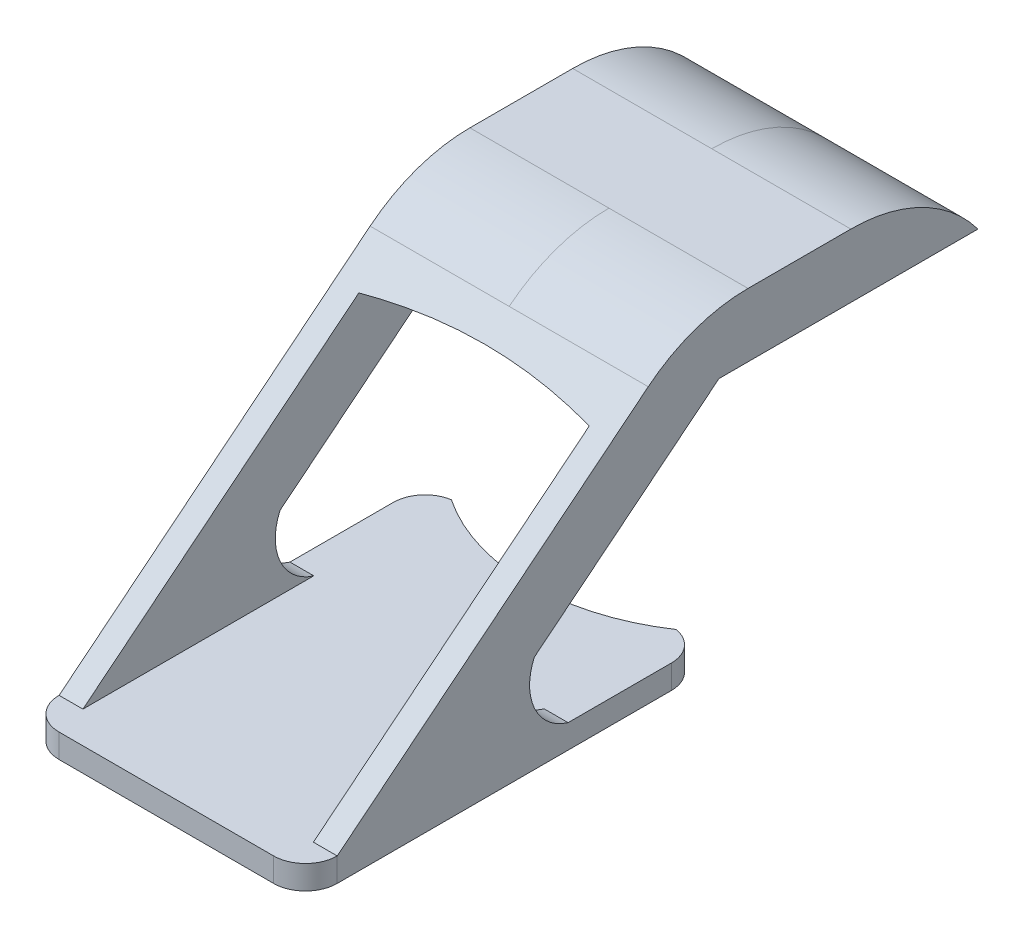
ISO-10303-21;
HEADER;
FILE_DESCRIPTION(('STEP AP214'),'2;1');
FILE_NAME('part.step','',(''),(''),'','','');
FILE_SCHEMA(('AUTOMOTIVE_DESIGN { 1 0 10303 214 1 1 1 1 }'));
ENDSEC;
DATA;
#1=APPLICATION_CONTEXT('core data for automotive mechanical design processes');
#2=APPLICATION_PROTOCOL_DEFINITION('international standard','automotive_design',2000,#1);
#3=PRODUCT_CONTEXT('',#1,'mechanical');
#4=PRODUCT('Part','Part','',(#3));
#5=PRODUCT_RELATED_PRODUCT_CATEGORY('part','',(#4));
#6=PRODUCT_DEFINITION_FORMATION('','',#4);
#7=PRODUCT_DEFINITION_CONTEXT('part definition',#1,'design');
#8=PRODUCT_DEFINITION('design','',#6,#7);
#9=PRODUCT_DEFINITION_SHAPE('','',#8);
#10=(LENGTH_UNIT() NAMED_UNIT(*) SI_UNIT(.MILLI.,.METRE.));
#11=(NAMED_UNIT(*) PLANE_ANGLE_UNIT() SI_UNIT($,.RADIAN.));
#12=(NAMED_UNIT(*) SI_UNIT($,.STERADIAN.) SOLID_ANGLE_UNIT());
#13=UNCERTAINTY_MEASURE_WITH_UNIT(LENGTH_MEASURE(1.E-05),#10,'distance_accuracy_value','');
#14=(GEOMETRIC_REPRESENTATION_CONTEXT(3) GLOBAL_UNCERTAINTY_ASSIGNED_CONTEXT((#13)) GLOBAL_UNIT_ASSIGNED_CONTEXT((#10,
#11,#12)) REPRESENTATION_CONTEXT('',''));
#15=CARTESIAN_POINT('',(0.,0.,0.));
#16=DIRECTION('',(0.,0.,1.));
#17=DIRECTION('',(1.,0.,0.));
#18=AXIS2_PLACEMENT_3D('',#15,#16,#17);
#19=CARTESIAN_POINT('',(-44.1526974655292,15.5,-29.8170025359344));
#20=DIRECTION('',(0.,-1.,0.));
#21=DIRECTION('',(0.,0.,-1.));
#22=AXIS2_PLACEMENT_3D('',#19,#20,#21);
#23=PLANE('',#22);
#24=DIRECTION('',(0.,0.,1.));
#25=VECTOR('',#24,1.);
#26=CARTESIAN_POINT('',(7.25,15.5,-29.8170025359344));
#27=LINE('',#26,#25);
#28=CARTESIAN_POINT('',(7.25,15.5,-29.8170025359344));
#29=VERTEX_POINT('',#28);
#30=CARTESIAN_POINT('',(7.25,15.5,-13.5184834552232));
#31=VERTEX_POINT('',#30);
#32=EDGE_CURVE('E298',#29,#31,#27,.T.);
#33=ORIENTED_EDGE('',*,*,#32,.F.);
#34=DIRECTION('',(1.,0.,0.));
#35=VECTOR('',#34,1.);
#36=CARTESIAN_POINT('',(-44.1526974655292,15.5,-29.8170025359344));
#37=LINE('',#36,#35);
#38=CARTESIAN_POINT('',(8.75,15.5,-29.8170025359344));
#39=VERTEX_POINT('',#38);
#40=EDGE_CURVE('E354',#29,#39,#37,.T.);
#41=ORIENTED_EDGE('',*,*,#40,.T.);
#42=DIRECTION('',(0.,0.,-1.));
#43=VECTOR('',#42,1.);
#44=CARTESIAN_POINT('',(8.75,15.5,-29.8170025359344));
#45=LINE('',#44,#43);
#46=CARTESIAN_POINT('',(8.75,15.5,-13.5184834552232));
#47=VERTEX_POINT('',#46);
#48=EDGE_CURVE('E335',#47,#39,#45,.T.);
#49=ORIENTED_EDGE('',*,*,#48,.F.);
#50=DIRECTION('',(1.,0.,0.));
#51=VECTOR('',#50,1.);
#52=CARTESIAN_POINT('',(-44.1526974655292,15.5,-13.5184834552232));
#53=LINE('',#52,#51);
#54=EDGE_CURVE('E361',#31,#47,#53,.T.);
#55=ORIENTED_EDGE('',*,*,#54,.F.);
#56=EDGE_LOOP('',(#33,#41,#49,#55));
#57=FACE_BOUND('',#56,.T.);
#58=ADVANCED_FACE('F133',(#57),#23,.T.);
#59=CARTESIAN_POINT('',(-44.1526974655292,15.5,-13.5184834552232));
#60=DIRECTION('',(0.,-0.778371839235594,-0.627803536056463));
#61=DIRECTION('',(0.,0.627803536056463,-0.778371839235594));
#62=AXIS2_PLACEMENT_3D('',#59,#60,#61);
#63=PLANE('',#62);
#64=DIRECTION('',(0.,0.627803536056463,-0.778371839235594));
#65=VECTOR('',#64,1.);
#66=CARTESIAN_POINT('',(-7.25,15.5,-13.5184834552232));
#67=LINE('',#66,#65);
#68=CARTESIAN_POINT('',(-7.25,6.12865774232497,-1.89957962579863));
#69=VERTEX_POINT('',#68);
#70=CARTESIAN_POINT('',(-7.25,15.5,-13.5184834552232));
#71=VERTEX_POINT('',#70);
#72=EDGE_CURVE('E537',#69,#71,#67,.T.);
#73=ORIENTED_EDGE('',*,*,#72,.F.);
#74=DIRECTION('',(1.,0.,0.));
#75=VECTOR('',#74,1.);
#76=CARTESIAN_POINT('',(-44.1526974655292,6.12865774232497,-1.89957962579863));
#77=LINE('',#76,#75);
#78=CARTESIAN_POINT('',(-8.75,6.12865774232497,-1.89957962579863));
#79=VERTEX_POINT('',#78);
#80=EDGE_CURVE('E362',#79,#69,#77,.T.);
#81=ORIENTED_EDGE('',*,*,#80,.F.);
#82=DIRECTION('',(0.,0.627803536056463,-0.778371839235594));
#83=VECTOR('',#82,1.);
#84=CARTESIAN_POINT('',(-8.75,15.5,-13.5184834552232));
#85=LINE('',#84,#83);
#86=CARTESIAN_POINT('',(-8.75,15.5,-13.5184834552232));
#87=VERTEX_POINT('',#86);
#88=EDGE_CURVE('E323',#79,#87,#85,.T.);
#89=ORIENTED_EDGE('',*,*,#88,.T.);
#90=EDGE_CURVE('E357',#87,#71,#53,.T.);
#91=ORIENTED_EDGE('',*,*,#90,.T.);
#92=EDGE_LOOP('',(#73,#81,#89,#91));
#93=FACE_BOUND('',#92,.T.);
#94=ADVANCED_FACE('F640',(#93),#63,.T.);
#95=CARTESIAN_POINT('',(-44.1526974655292,4.74535597453624,-4.9898474129076));
#96=DIRECTION('',(1.,0.,0.));
#97=DIRECTION('',(0.,0.,-1.));
#98=AXIS2_PLACEMENT_3D('',#95,#96,#97);
#99=CYLINDRICAL_SURFACE('',#98,3.38574641354175);
#100=CARTESIAN_POINT('',(-7.25,4.74535597453624,-4.98984741290761));
#101=DIRECTION('',(-1.,0.,0.));
#102=DIRECTION('',(0.,-1.,0.));
#103=AXIS2_PLACEMENT_3D('',#100,#101,#102);
#104=CIRCLE('',#103,3.38574641354175);
#105=CARTESIAN_POINT('',(-7.25,1.5,-4.024993343448));
#106=VERTEX_POINT('',#105);
#107=EDGE_CURVE('E540',#106,#69,#104,.T.);
#108=ORIENTED_EDGE('',*,*,#107,.F.);
#109=DIRECTION('',(1.,0.,0.));
#110=VECTOR('',#109,1.);
#111=CARTESIAN_POINT('',(-44.1526974655292,1.5,-4.02499334344799));
#112=LINE('',#111,#110);
#113=CARTESIAN_POINT('',(-8.75,1.5,-4.024993343448));
#114=VERTEX_POINT('',#113);
#115=EDGE_CURVE('E367',#114,#106,#112,.T.);
#116=ORIENTED_EDGE('',*,*,#115,.F.);
#117=CARTESIAN_POINT('',(-8.75,4.74535597453624,-4.98984741290761));
#118=DIRECTION('',(-1.,0.,0.));
#119=DIRECTION('',(0.,0.,-1.));
#120=AXIS2_PLACEMENT_3D('',#117,#118,#119);
#121=CIRCLE('',#120,3.38574641354175);
#122=EDGE_CURVE('E517',#114,#79,#121,.T.);
#123=ORIENTED_EDGE('',*,*,#122,.T.);
#124=ORIENTED_EDGE('',*,*,#80,.T.);
#125=EDGE_LOOP('',(#108,#116,#123,#124));
#126=FACE_BOUND('',#125,.T.);
#127=ADVANCED_FACE('F632',(#126),#99,.F.);
#128=CARTESIAN_POINT('',(0.,1.5,0.));
#129=DIRECTION('',(0.,1.,0.));
#130=DIRECTION('',(0.,0.,1.));
#131=AXIS2_PLACEMENT_3D('',#128,#129,#130);
#132=PLANE('',#131);
#133=DIRECTION('',(1.,0.,0.));
#134=VECTOR('',#133,1.);
#135=CARTESIAN_POINT('',(-44.1526974655292,1.5,10.5));
#136=LINE('',#135,#134);
#137=CARTESIAN_POINT('',(7.25,1.5,10.5));
#138=VERTEX_POINT('',#137);
#139=CARTESIAN_POINT('',(8.75,1.5,10.5));
#140=VERTEX_POINT('',#139);
#141=EDGE_CURVE('E353',#138,#140,#136,.T.);
#142=ORIENTED_EDGE('',*,*,#141,.F.);
#143=DIRECTION('',(0.,0.,1.));
#144=VECTOR('',#143,1.);
#145=CARTESIAN_POINT('',(7.25,1.5,-33.5));
#146=LINE('',#145,#144);
#147=CARTESIAN_POINT('',(7.24999999999999,1.5,-4.024993343448));
#148=VERTEX_POINT('',#147);
#149=EDGE_CURVE('E156',#148,#138,#146,.T.);
#150=ORIENTED_EDGE('',*,*,#149,.F.);
#151=CARTESIAN_POINT('',(8.75,1.5,-4.024993343448));
#152=VERTEX_POINT('',#151);
#153=EDGE_CURVE('E347',#148,#152,#112,.T.);
#154=ORIENTED_EDGE('',*,*,#153,.T.);
#155=DIRECTION('',(0.,0.,1.));
#156=VECTOR('',#155,1.);
#157=CARTESIAN_POINT('',(8.75,1.5,0.));
#158=LINE('',#157,#156);
#159=CARTESIAN_POINT('',(8.75,1.5,-10.5257957837697));
#160=VERTEX_POINT('',#159);
#161=EDGE_CURVE('E383',#160,#152,#158,.T.);
#162=ORIENTED_EDGE('',*,*,#161,.F.);
#163=CARTESIAN_POINT('',(6.75,1.5,-10.5257957837697));
#164=DIRECTION('',(0.,1.,0.));
#165=DIRECTION('',(0.,0.,1.));
#166=AXIS2_PLACEMENT_3D('',#163,#164,#165);
#167=CIRCLE('',#166,2.);
#168=CARTESIAN_POINT('',(7.07018387313917,1.5,-12.5));
#169=VERTEX_POINT('',#168);
#170=EDGE_CURVE('E435',#160,#169,#167,.T.);
#171=ORIENTED_EDGE('',*,*,#170,.T.);
#172=CARTESIAN_POINT('',(0.,1.5,-23.0500000000001));
#173=DIRECTION('',(0.,1.,0.));
#174=DIRECTION('',(0.,0.,1.));
#175=AXIS2_PLACEMENT_3D('',#172,#173,#174);
#176=CIRCLE('',#175,12.7);
#177=CARTESIAN_POINT('',(-7.07018387313919,1.5,-12.5));
#178=VERTEX_POINT('',#177);
#179=EDGE_CURVE('E370',#178,#169,#176,.T.);
#180=ORIENTED_EDGE('',*,*,#179,.F.);
#181=CARTESIAN_POINT('',(-6.75,1.5,-10.5257957837697));
#182=DIRECTION('',(0.,1.,0.));
#183=DIRECTION('',(0.,0.,1.));
#184=AXIS2_PLACEMENT_3D('',#181,#182,#183);
#185=CIRCLE('',#184,2.);
#186=CARTESIAN_POINT('',(-8.75,1.5,-10.5257957837697));
#187=VERTEX_POINT('',#186);
#188=EDGE_CURVE('E438',#178,#187,#185,.T.);
#189=ORIENTED_EDGE('',*,*,#188,.T.);
#190=DIRECTION('',(0.,0.,1.));
#191=VECTOR('',#190,1.);
#192=CARTESIAN_POINT('',(-8.75,1.5,0.));
#193=LINE('',#192,#191);
#194=EDGE_CURVE('E374',#187,#114,#193,.T.);
#195=ORIENTED_EDGE('',*,*,#194,.T.);
#196=ORIENTED_EDGE('',*,*,#115,.T.);
#197=DIRECTION('',(0.,0.,1.));
#198=VECTOR('',#197,1.);
#199=CARTESIAN_POINT('',(-7.25,1.5,-33.5));
#200=LINE('',#199,#198);
#201=CARTESIAN_POINT('',(-7.25000000000001,1.5,10.5));
#202=VERTEX_POINT('',#201);
#203=EDGE_CURVE('E149',#106,#202,#200,.T.);
#204=ORIENTED_EDGE('',*,*,#203,.T.);
#205=CARTESIAN_POINT('',(-8.75,1.5,10.5));
#206=VERTEX_POINT('',#205);
#207=EDGE_CURVE('E348',#206,#202,#136,.T.);
#208=ORIENTED_EDGE('',*,*,#207,.F.);
#209=CARTESIAN_POINT('',(-6.75,1.5,10.5));
#210=DIRECTION('',(0.,1.,0.));
#211=DIRECTION('',(0.,0.,1.));
#212=AXIS2_PLACEMENT_3D('',#209,#210,#211);
#213=CIRCLE('',#212,2.);
#214=CARTESIAN_POINT('',(-6.75,1.5,12.5));
#215=VERTEX_POINT('',#214);
#216=EDGE_CURVE('E432',#206,#215,#213,.T.);
#217=ORIENTED_EDGE('',*,*,#216,.T.);
#218=DIRECTION('',(1.,0.,0.));
#219=VECTOR('',#218,1.);
#220=CARTESIAN_POINT('',(0.,1.5,12.5));
#221=LINE('',#220,#219);
#222=CARTESIAN_POINT('',(6.75,1.5,12.5));
#223=VERTEX_POINT('',#222);
#224=EDGE_CURVE('E379',#215,#223,#221,.T.);
#225=ORIENTED_EDGE('',*,*,#224,.T.);
#226=CARTESIAN_POINT('',(6.75,1.5,10.5));
#227=DIRECTION('',(0.,1.,0.));
#228=DIRECTION('',(0.,0.,1.));
#229=AXIS2_PLACEMENT_3D('',#226,#227,#228);
#230=CIRCLE('',#229,2.);
#231=EDGE_CURVE('E429',#223,#140,#230,.T.);
#232=ORIENTED_EDGE('',*,*,#231,.T.);
#233=EDGE_LOOP('',(#142,#150,#154,#162,#171,#180,#189,#195,#196,#204,#208,#217,#225,#232));
#234=FACE_BOUND('',#233,.T.);
#235=ADVANCED_FACE('F621',(#234),#132,.T.);
#236=CARTESIAN_POINT('',(-8.75,1.5,0.));
#237=DIRECTION('',(1.,0.,0.));
#238=DIRECTION('',(0.,0.,-1.));
#239=AXIS2_PLACEMENT_3D('',#236,#237,#238);
#240=PLANE('',#239);
#241=DIRECTION('',(0.,-0.627803536056463,0.778371839235594));
#242=VECTOR('',#241,1.);
#243=CARTESIAN_POINT('',(-8.75,1.5,10.5));
#244=LINE('',#243,#242);
#245=CARTESIAN_POINT('',(-8.75,17.2837183923559,-9.06918241048236));
#246=VERTEX_POINT('',#245);
#247=EDGE_CURVE('E321',#246,#206,#244,.T.);
#248=ORIENTED_EDGE('',*,*,#247,.F.);
#249=CARTESIAN_POINT('',(-8.75,9.5,-15.347217771047));
#250=DIRECTION('',(1.,0.,0.));
#251=DIRECTION('',(0.,0.,-1.));
#252=AXIS2_PLACEMENT_3D('',#249,#250,#251);
#253=CIRCLE('',#252,10.);
#254=CARTESIAN_POINT('',(-8.75,19.5,-15.347217771047));
#255=VERTEX_POINT('',#254);
#256=EDGE_CURVE('E142',#246,#255,#253,.F.);
#257=ORIENTED_EDGE('',*,*,#256,.T.);
#258=DIRECTION('',(0.,0.,1.));
#259=VECTOR('',#258,1.);
#260=CARTESIAN_POINT('',(-8.75,19.5,-11.8170025359344));
#261=LINE('',#260,#259);
#262=CARTESIAN_POINT('',(-8.75,19.5,-21.8170025359344));
#263=VERTEX_POINT('',#262);
#264=EDGE_CURVE('E316',#263,#255,#261,.T.);
#265=ORIENTED_EDGE('',*,*,#264,.F.);
#266=CARTESIAN_POINT('',(-8.75,9.5,-21.8170025359344));
#267=DIRECTION('',(1.,0.,0.));
#268=DIRECTION('',(0.,0.,-1.));
#269=AXIS2_PLACEMENT_3D('',#266,#267,#268);
#270=CIRCLE('',#269,10.);
#271=CARTESIAN_POINT('',(-8.75,15.5,-29.8170025359344));
#272=VERTEX_POINT('',#271);
#273=EDGE_CURVE('E481',#263,#272,#270,.F.);
#274=ORIENTED_EDGE('',*,*,#273,.T.);
#275=DIRECTION('',(0.,0.,-1.));
#276=VECTOR('',#275,1.);
#277=CARTESIAN_POINT('',(-8.75,15.5,-29.8170025359344));
#278=LINE('',#277,#276);
#279=EDGE_CURVE('E314',#87,#272,#278,.T.);
#280=ORIENTED_EDGE('',*,*,#279,.F.);
#281=ORIENTED_EDGE('',*,*,#88,.F.);
#282=ORIENTED_EDGE('',*,*,#122,.F.);
#283=ORIENTED_EDGE('',*,*,#194,.F.);
#284=DIRECTION('',(0.,-1.,0.));
#285=VECTOR('',#284,1.);
#286=CARTESIAN_POINT('',(-8.75,1.5,-10.5257957837697));
#287=LINE('',#286,#285);
#288=CARTESIAN_POINT('',(-8.75,0.,-10.5257957837697));
#289=VERTEX_POINT('',#288);
#290=EDGE_CURVE('E413',#187,#289,#287,.T.);
#291=ORIENTED_EDGE('',*,*,#290,.T.);
#292=DIRECTION('',(0.,0.,1.));
#293=VECTOR('',#292,1.);
#294=CARTESIAN_POINT('',(-8.75,0.,0.));
#295=LINE('',#294,#293);
#296=CARTESIAN_POINT('',(-8.75,0.,10.5));
#297=VERTEX_POINT('',#296);
#298=EDGE_CURVE('E391',#289,#297,#295,.T.);
#299=ORIENTED_EDGE('',*,*,#298,.T.);
#300=DIRECTION('',(0.,-1.,0.));
#301=VECTOR('',#300,1.);
#302=CARTESIAN_POINT('',(-8.75,1.5,10.5));
#303=LINE('',#302,#301);
#304=EDGE_CURVE('E409',#297,#206,#303,.F.);
#305=ORIENTED_EDGE('',*,*,#304,.T.);
#306=EDGE_LOOP('',(#248,#257,#265,#274,#280,#281,#282,#283,#291,#299,#305));
#307=FACE_BOUND('',#306,.T.);
#308=ADVANCED_FACE('F491',(#307),#240,.F.);
#309=CARTESIAN_POINT('',(0.,1.5,12.5));
#310=DIRECTION('',(0.,0.,-1.));
#311=DIRECTION('',(-1.,0.,0.));
#312=AXIS2_PLACEMENT_3D('',#309,#310,#311);
#313=PLANE('',#312);
#314=ORIENTED_EDGE('',*,*,#224,.F.);
#315=DIRECTION('',(0.,-1.,0.));
#316=VECTOR('',#315,1.);
#317=CARTESIAN_POINT('',(-6.75,1.5,12.5));
#318=LINE('',#317,#316);
#319=CARTESIAN_POINT('',(-6.75,0.,12.5));
#320=VERTEX_POINT('',#319);
#321=EDGE_CURVE('E451',#215,#320,#318,.T.);
#322=ORIENTED_EDGE('',*,*,#321,.T.);
#323=DIRECTION('',(1.,0.,0.));
#324=VECTOR('',#323,1.);
#325=CARTESIAN_POINT('',(0.,0.,12.5));
#326=LINE('',#325,#324);
#327=CARTESIAN_POINT('',(6.75,0.,12.5));
#328=VERTEX_POINT('',#327);
#329=EDGE_CURVE('E395',#320,#328,#326,.T.);
#330=ORIENTED_EDGE('',*,*,#329,.T.);
#331=DIRECTION('',(0.,-1.,0.));
#332=VECTOR('',#331,1.);
#333=CARTESIAN_POINT('',(6.75,1.5,12.5));
#334=LINE('',#333,#332);
#335=EDGE_CURVE('E448',#328,#223,#334,.F.);
#336=ORIENTED_EDGE('',*,*,#335,.T.);
#337=EDGE_LOOP('',(#314,#322,#330,#336));
#338=FACE_BOUND('',#337,.T.);
#339=ADVANCED_FACE('F620',(#338),#313,.F.);
#340=CARTESIAN_POINT('',(8.75,1.5,0.));
#341=DIRECTION('',(1.,0.,0.));
#342=DIRECTION('',(0.,0.,-1.));
#343=AXIS2_PLACEMENT_3D('',#340,#341,#342);
#344=PLANE('',#343);
#345=DIRECTION('',(0.,0.,1.));
#346=VECTOR('',#345,1.);
#347=CARTESIAN_POINT('',(8.75,19.5,-11.8170025359344));
#348=LINE('',#347,#346);
#349=CARTESIAN_POINT('',(8.75,19.5,-21.8170025359344));
#350=VERTEX_POINT('',#349);
#351=CARTESIAN_POINT('',(8.75,19.5,-15.347217771047));
#352=VERTEX_POINT('',#351);
#353=EDGE_CURVE('E339',#350,#352,#348,.T.);
#354=ORIENTED_EDGE('',*,*,#353,.T.);
#355=CARTESIAN_POINT('',(8.75,9.5,-15.347217771047));
#356=DIRECTION('',(1.,0.,0.));
#357=DIRECTION('',(0.,0.,-1.));
#358=AXIS2_PLACEMENT_3D('',#355,#356,#357);
#359=CIRCLE('',#358,10.);
#360=CARTESIAN_POINT('',(8.75,17.2837183923559,-9.06918241048237));
#361=VERTEX_POINT('',#360);
#362=EDGE_CURVE('E467',#352,#361,#359,.T.);
#363=ORIENTED_EDGE('',*,*,#362,.T.);
#364=DIRECTION('',(0.,-0.627803536056463,0.778371839235594));
#365=VECTOR('',#364,1.);
#366=CARTESIAN_POINT('',(8.75,1.5,10.5));
#367=LINE('',#366,#365);
#368=EDGE_CURVE('E343',#361,#140,#367,.T.);
#369=ORIENTED_EDGE('',*,*,#368,.T.);
#370=DIRECTION('',(0.,-1.,0.));
#371=VECTOR('',#370,1.);
#372=CARTESIAN_POINT('',(8.75,0.,10.5));
#373=LINE('',#372,#371);
#374=CARTESIAN_POINT('',(8.75,0.,10.5));
#375=VERTEX_POINT('',#374);
#376=EDGE_CURVE('E441',#140,#375,#373,.T.);
#377=ORIENTED_EDGE('',*,*,#376,.T.);
#378=DIRECTION('',(0.,0.,1.));
#379=VECTOR('',#378,1.);
#380=CARTESIAN_POINT('',(8.75,0.,0.));
#381=LINE('',#380,#379);
#382=CARTESIAN_POINT('',(8.75,0.,-10.5257957837697));
#383=VERTEX_POINT('',#382);
#384=EDGE_CURVE('E375',#383,#375,#381,.T.);
#385=ORIENTED_EDGE('',*,*,#384,.F.);
#386=DIRECTION('',(0.,1.,0.));
#387=VECTOR('',#386,1.);
#388=CARTESIAN_POINT('',(8.75,1.5,-10.5257957837697));
#389=LINE('',#388,#387);
#390=EDGE_CURVE('E445',#383,#160,#389,.T.);
#391=ORIENTED_EDGE('',*,*,#390,.T.);
#392=ORIENTED_EDGE('',*,*,#161,.T.);
#393=CARTESIAN_POINT('',(8.75,4.74535597453624,-4.98984741290761));
#394=DIRECTION('',(-1.,0.,0.));
#395=DIRECTION('',(0.,0.,-1.));
#396=AXIS2_PLACEMENT_3D('',#393,#394,#395);
#397=CIRCLE('',#396,3.38574641354175);
#398=CARTESIAN_POINT('',(8.75,6.12865774232497,-1.89957962579863));
#399=VERTEX_POINT('',#398);
#400=EDGE_CURVE('E327',#152,#399,#397,.T.);
#401=ORIENTED_EDGE('',*,*,#400,.T.);
#402=DIRECTION('',(0.,0.627803536056463,-0.778371839235594));
#403=VECTOR('',#402,1.);
#404=CARTESIAN_POINT('',(8.75,15.5,-13.5184834552232));
#405=LINE('',#404,#403);
#406=EDGE_CURVE('E331',#399,#47,#405,.T.);
#407=ORIENTED_EDGE('',*,*,#406,.T.);
#408=ORIENTED_EDGE('',*,*,#48,.T.);
#409=CARTESIAN_POINT('',(8.75,9.5,-21.8170025359344));
#410=DIRECTION('',(1.,0.,0.));
#411=DIRECTION('',(0.,0.,-1.));
#412=AXIS2_PLACEMENT_3D('',#409,#410,#411);
#413=CIRCLE('',#412,10.);
#414=EDGE_CURVE('E455',#39,#350,#413,.T.);
#415=ORIENTED_EDGE('',*,*,#414,.T.);
#416=EDGE_LOOP('',(#354,#363,#369,#377,#385,#391,#392,#401,#407,#408,#415));
#417=FACE_BOUND('',#416,.T.);
#418=ADVANCED_FACE('F505',(#417),#344,.T.);
#419=CARTESIAN_POINT('',(0.,1.5,-23.0500000000001));
#420=DIRECTION('',(0.,-1.,0.));
#421=DIRECTION('',(0.,0.,-1.));
#422=AXIS2_PLACEMENT_3D('',#419,#420,#421);
#423=CYLINDRICAL_SURFACE('',#422,12.7);
#424=CARTESIAN_POINT('',(0.,0.,-23.0500000000001));
#425=DIRECTION('',(0.,1.,0.));
#426=DIRECTION('',(0.,0.,1.));
#427=AXIS2_PLACEMENT_3D('',#424,#425,#426);
#428=CIRCLE('',#427,12.7);
#429=CARTESIAN_POINT('',(-7.07018387313919,0.,-12.5));
#430=VERTEX_POINT('',#429);
#431=CARTESIAN_POINT('',(7.07018387313917,0.,-12.5));
#432=VERTEX_POINT('',#431);
#433=EDGE_CURVE('E352',#430,#432,#428,.T.);
#434=ORIENTED_EDGE('',*,*,#433,.F.);
#435=DIRECTION('',(0.,-1.,0.));
#436=VECTOR('',#435,1.);
#437=CARTESIAN_POINT('',(-7.07018387313919,1.5,-12.5));
#438=LINE('',#437,#436);
#439=EDGE_CURVE('E405',#178,#430,#438,.T.);
#440=ORIENTED_EDGE('',*,*,#439,.F.);
#441=ORIENTED_EDGE('',*,*,#179,.T.);
#442=DIRECTION('',(0.,-1.,0.));
#443=VECTOR('',#442,1.);
#444=CARTESIAN_POINT('',(7.07018387313917,1.5,-12.5));
#445=LINE('',#444,#443);
#446=EDGE_CURVE('E387',#169,#432,#445,.T.);
#447=ORIENTED_EDGE('',*,*,#446,.T.);
#448=EDGE_LOOP('',(#434,#440,#441,#447));
#449=FACE_BOUND('',#448,.T.);
#450=ADVANCED_FACE('F614',(#449),#423,.F.);
#451=CARTESIAN_POINT('',(0.,0.,0.));
#452=DIRECTION('',(0.,1.,0.));
#453=DIRECTION('',(0.,0.,1.));
#454=AXIS2_PLACEMENT_3D('',#451,#452,#453);
#455=PLANE('',#454);
#456=ORIENTED_EDGE('',*,*,#298,.F.);
#457=CARTESIAN_POINT('',(-6.75,0.,-10.5257957837697));
#458=DIRECTION('',(0.,1.,0.));
#459=DIRECTION('',(0.,0.,1.));
#460=AXIS2_PLACEMENT_3D('',#457,#458,#459);
#461=CIRCLE('',#460,2.);
#462=EDGE_CURVE('E426',#289,#430,#461,.F.);
#463=ORIENTED_EDGE('',*,*,#462,.T.);
#464=ORIENTED_EDGE('',*,*,#433,.T.);
#465=CARTESIAN_POINT('',(6.75,0.,-10.5257957837697));
#466=DIRECTION('',(0.,1.,0.));
#467=DIRECTION('',(0.,0.,1.));
#468=AXIS2_PLACEMENT_3D('',#465,#466,#467);
#469=CIRCLE('',#468,2.);
#470=EDGE_CURVE('E423',#432,#383,#469,.F.);
#471=ORIENTED_EDGE('',*,*,#470,.T.);
#472=ORIENTED_EDGE('',*,*,#384,.T.);
#473=CARTESIAN_POINT('',(6.75,0.,10.5));
#474=DIRECTION('',(0.,1.,0.));
#475=DIRECTION('',(0.,0.,1.));
#476=AXIS2_PLACEMENT_3D('',#473,#474,#475);
#477=CIRCLE('',#476,2.);
#478=EDGE_CURVE('E417',#375,#328,#477,.F.);
#479=ORIENTED_EDGE('',*,*,#478,.T.);
#480=ORIENTED_EDGE('',*,*,#329,.F.);
#481=CARTESIAN_POINT('',(-6.75,0.,10.5));
#482=DIRECTION('',(0.,1.,0.));
#483=DIRECTION('',(0.,0.,1.));
#484=AXIS2_PLACEMENT_3D('',#481,#482,#483);
#485=CIRCLE('',#484,2.);
#486=EDGE_CURVE('E420',#320,#297,#485,.F.);
#487=ORIENTED_EDGE('',*,*,#486,.T.);
#488=EDGE_LOOP('',(#456,#463,#464,#471,#472,#479,#480,#487));
#489=FACE_BOUND('',#488,.T.);
#490=ADVANCED_FACE('F612',(#489),#455,.F.);
#491=CARTESIAN_POINT('',(-6.75,1.5,-10.5257957837697));
#492=DIRECTION('',(0.,-1.,0.));
#493=DIRECTION('',(0.,0.,-1.));
#494=AXIS2_PLACEMENT_3D('',#491,#492,#493);
#495=CYLINDRICAL_SURFACE('',#494,2.);
#496=ORIENTED_EDGE('',*,*,#188,.F.);
#497=ORIENTED_EDGE('',*,*,#439,.T.);
#498=ORIENTED_EDGE('',*,*,#462,.F.);
#499=ORIENTED_EDGE('',*,*,#290,.F.);
#500=EDGE_LOOP('',(#496,#497,#498,#499));
#501=FACE_BOUND('',#500,.T.);
#502=ADVANCED_FACE('F608',(#501),#495,.T.);
#503=CARTESIAN_POINT('',(6.75,1.5,-10.5257957837697));
#504=DIRECTION('',(0.,-1.,0.));
#505=DIRECTION('',(0.,0.,-1.));
#506=AXIS2_PLACEMENT_3D('',#503,#504,#505);
#507=CYLINDRICAL_SURFACE('',#506,2.);
#508=ORIENTED_EDGE('',*,*,#170,.F.);
#509=ORIENTED_EDGE('',*,*,#390,.F.);
#510=ORIENTED_EDGE('',*,*,#470,.F.);
#511=ORIENTED_EDGE('',*,*,#446,.F.);
#512=EDGE_LOOP('',(#508,#509,#510,#511));
#513=FACE_BOUND('',#512,.T.);
#514=ADVANCED_FACE('F604',(#513),#507,.T.);
#515=CARTESIAN_POINT('',(-6.75,1.5,10.5));
#516=DIRECTION('',(0.,-1.,0.));
#517=DIRECTION('',(0.,0.,-1.));
#518=AXIS2_PLACEMENT_3D('',#515,#516,#517);
#519=CYLINDRICAL_SURFACE('',#518,2.);
#520=ORIENTED_EDGE('',*,*,#216,.F.);
#521=ORIENTED_EDGE('',*,*,#304,.F.);
#522=ORIENTED_EDGE('',*,*,#486,.F.);
#523=ORIENTED_EDGE('',*,*,#321,.F.);
#524=EDGE_LOOP('',(#520,#521,#522,#523));
#525=FACE_BOUND('',#524,.T.);
#526=ADVANCED_FACE('F600',(#525),#519,.T.);
#527=CARTESIAN_POINT('',(6.75,1.5,10.5));
#528=DIRECTION('',(0.,1.,0.));
#529=DIRECTION('',(0.,0.,1.));
#530=AXIS2_PLACEMENT_3D('',#527,#528,#529);
#531=CYLINDRICAL_SURFACE('',#530,2.);
#532=ORIENTED_EDGE('',*,*,#231,.F.);
#533=ORIENTED_EDGE('',*,*,#335,.F.);
#534=ORIENTED_EDGE('',*,*,#478,.F.);
#535=ORIENTED_EDGE('',*,*,#376,.F.);
#536=EDGE_LOOP('',(#532,#533,#534,#535));
#537=FACE_BOUND('',#536,.T.);
#538=ADVANCED_FACE('F597',(#537),#531,.T.);
#539=CARTESIAN_POINT('',(-44.1526974655292,1.5,10.5));
#540=DIRECTION('',(0.,0.778371839235594,0.627803536056463));
#541=DIRECTION('',(0.,-0.627803536056463,0.778371839235594));
#542=AXIS2_PLACEMENT_3D('',#539,#540,#541);
#543=PLANE('',#542);
#544=CARTESIAN_POINT('',(7.25,15.5,-6.85766863906011));
#545=CARTESIAN_POINT('',(6.95188883757576,15.5428731195942,-6.91082416787725));
#546=CARTESIAN_POINT('',(6.65287106125705,15.5832295257511,-6.96085939112973));
#547=CARTESIAN_POINT('',(6.05318507320041,15.658801278349,-7.05455577970591));
#548=CARTESIAN_POINT('',(5.75251682300973,15.6940165044787,-7.09821679586369));
#549=CARTESIAN_POINT('',(4.84845029432404,15.7917700369567,-7.21941489765302));
#550=CARTESIAN_POINT('',(4.24284295474979,15.8464374614244,-7.28719340045735));
#551=CARTESIAN_POINT('',(3.02753631670595,15.9340711770603,-7.39584461457297));
#552=CARTESIAN_POINT('',(2.41783634108112,15.9670337829094,-7.43671275670206));
#553=CARTESIAN_POINT('',(1.50179979351017,15.9998740387794,-7.47742920523163));
#554=CARTESIAN_POINT('',(1.19617240088828,16.0080535012157,-7.48757037656124));
#555=CARTESIAN_POINT('',(0.584650193879477,16.0188545842501,-7.50096192086519));
#556=CARTESIAN_POINT('',(0.278755363881687,16.0214758552462,-7.50421186039112));
#557=CARTESIAN_POINT('',(-0.633616170806697,16.0209814270579,-7.50359885177262));
#558=CARTESIAN_POINT('',(-1.24013357429355,16.0096988688072,-7.48961035837859));
#559=CARTESIAN_POINT('',(-2.45125049426661,15.9653626851951,-7.43464087381723));
#560=CARTESIAN_POINT('',(-3.05584947712678,15.9323034588825,-7.39365293840313));
#561=CARTESIAN_POINT('',(-4.26230149100891,15.8447491473836,-7.28510017219462));
#562=CARTESIAN_POINT('',(-4.86414703910398,15.7902131033359,-7.21748455923278));
#563=CARTESIAN_POINT('',(-5.76246516651067,15.6928685222147,-7.09679348902492));
#564=CARTESIAN_POINT('',(-6.0611301862553,15.6578349577032,-7.05335770302237));
#565=CARTESIAN_POINT('',(-6.65682766935154,15.5826952977021,-6.96019703731171));
#566=CARTESIAN_POINT('',(-6.9538601840057,15.5425893625773,-6.9104723564291));
#567=CARTESIAN_POINT('',(-7.25,15.5,-6.85766863906011));
#568=B_SPLINE_CURVE_WITH_KNOTS('',3,(#544,#545,#546,#547,#548,#549,#550,#551,#552,#553,#554,
#555,#556,#557,#558,#559,#560,#561,#562,#563,#564,#565,#566,#567),.UNSPECIFIED.,.F.,.F.,(4,2,2,
2,2,2,2,2,2,2,2,4),(0.,0.917446727027816,1.83491492023086,3.66939855485372,5.50419359110179,
6.42179547192598,7.33945506685526,9.15871155492381,10.9784361379011,12.80164809183,
13.7130532839313,14.6244296688522),.UNSPECIFIED.);
#569=CARTESIAN_POINT('',(7.25,15.5,-6.85766863906013));
#570=VERTEX_POINT('',#569);
#571=CARTESIAN_POINT('',(-7.25,15.5,-6.85766863906011));
#572=VERTEX_POINT('',#571);
#573=EDGE_CURVE('E545',#570,#572,#568,.T.);
#574=ORIENTED_EDGE('',*,*,#573,.F.);
#575=DIRECTION('',(0.,0.627803536056463,-0.778371839235594));
#576=VECTOR('',#575,1.);
#577=CARTESIAN_POINT('',(7.25,1.5,10.5));
#578=LINE('',#577,#576);
#579=EDGE_CURVE('E522',#138,#570,#578,.T.);
#580=ORIENTED_EDGE('',*,*,#579,.F.);
#581=ORIENTED_EDGE('',*,*,#141,.T.);
#582=ORIENTED_EDGE('',*,*,#368,.F.);
#583=DIRECTION('',(1.,0.,0.));
#584=VECTOR('',#583,1.);
#585=CARTESIAN_POINT('',(-44.1526974655292,17.2837183923559,-9.06918241048235));
#586=LINE('',#585,#584);
#587=CARTESIAN_POINT('',(0.,17.2837183923559,-9.06918241048236));
#588=VERTEX_POINT('',#587);
#589=EDGE_CURVE('E470',#361,#588,#586,.F.);
#590=ORIENTED_EDGE('',*,*,#589,.T.);
#591=DIRECTION('',(-1.,0.,0.));
#592=VECTOR('',#591,1.);
#593=CARTESIAN_POINT('',(-44.1526974655292,17.2837183923559,-9.06918241048235));
#594=LINE('',#593,#592);
#595=EDGE_CURVE('E484',#588,#246,#594,.T.);
#596=ORIENTED_EDGE('',*,*,#595,.T.);
#597=ORIENTED_EDGE('',*,*,#247,.T.);
#598=ORIENTED_EDGE('',*,*,#207,.T.);
#599=DIRECTION('',(0.,-0.627803536056463,0.778371839235594));
#600=VECTOR('',#599,1.);
#601=CARTESIAN_POINT('',(-7.25,1.5,10.5));
#602=LINE('',#601,#600);
#603=EDGE_CURVE('E534',#572,#202,#602,.T.);
#604=ORIENTED_EDGE('',*,*,#603,.F.);
#605=EDGE_LOOP('',(#574,#580,#581,#582,#590,#596,#597,#598,#604));
#606=FACE_BOUND('',#605,.T.);
#607=ADVANCED_FACE('F566',(#606),#543,.T.);
#608=CARTESIAN_POINT('',(-44.1526974655292,19.5,-11.8170025359344));
#609=DIRECTION('',(0.,1.,0.));
#610=DIRECTION('',(0.,0.,1.));
#611=AXIS2_PLACEMENT_3D('',#608,#609,#610);
#612=PLANE('',#611);
#613=ORIENTED_EDGE('',*,*,#264,.T.);
#614=DIRECTION('',(-1.,0.,0.));
#615=VECTOR('',#614,1.);
#616=CARTESIAN_POINT('',(-44.1526974655292,19.5,-15.347217771047));
#617=LINE('',#616,#615);
#618=CARTESIAN_POINT('',(0.,19.5,-15.347217771047));
#619=VERTEX_POINT('',#618);
#620=EDGE_CURVE('E12',#255,#619,#617,.F.);
#621=ORIENTED_EDGE('',*,*,#620,.T.);
#622=DIRECTION('',(1.,0.,0.));
#623=VECTOR('',#622,1.);
#624=CARTESIAN_POINT('',(-44.1526974655292,19.5,-15.347217771047));
#625=LINE('',#624,#623);
#626=EDGE_CURVE('E463',#619,#352,#625,.T.);
#627=ORIENTED_EDGE('',*,*,#626,.T.);
#628=ORIENTED_EDGE('',*,*,#353,.F.);
#629=DIRECTION('',(1.,0.,0.));
#630=VECTOR('',#629,1.);
#631=CARTESIAN_POINT('',(0.,19.5,-21.8170025359344));
#632=LINE('',#631,#630);
#633=CARTESIAN_POINT('',(0.,19.5,-21.8170025359344));
#634=VERTEX_POINT('',#633);
#635=EDGE_CURVE('E458',#350,#634,#632,.F.);
#636=ORIENTED_EDGE('',*,*,#635,.T.);
#637=DIRECTION('',(-1.,0.,0.));
#638=VECTOR('',#637,1.);
#639=CARTESIAN_POINT('',(-8.75000000000001,19.5,-21.8170025359344));
#640=LINE('',#639,#638);
#641=EDGE_CURVE('E477',#634,#263,#640,.T.);
#642=ORIENTED_EDGE('',*,*,#641,.T.);
#643=EDGE_LOOP('',(#613,#621,#627,#628,#636,#642));
#644=FACE_BOUND('',#643,.T.);
#645=ADVANCED_FACE('F496',(#644),#612,.T.);
#646=DIRECTION('',(0.,0.,1.));
#647=VECTOR('',#646,1.);
#648=CARTESIAN_POINT('',(-7.25,15.5,-29.8170025359344));
#649=LINE('',#648,#647);
#650=CARTESIAN_POINT('',(-7.25,15.5,-29.8170025359344));
#651=VERTEX_POINT('',#650);
#652=EDGE_CURVE('E287',#651,#71,#649,.T.);
#653=ORIENTED_EDGE('',*,*,#652,.T.);
#654=ORIENTED_EDGE('',*,*,#90,.F.);
#655=ORIENTED_EDGE('',*,*,#279,.T.);
#656=DIRECTION('',(-1.,0.,0.));
#657=VECTOR('',#656,1.);
#658=CARTESIAN_POINT('',(44.1526974655291,15.5,-29.8170025359344));
#659=LINE('',#658,#657);
#660=EDGE_CURVE('E303',#651,#272,#659,.T.);
#661=ORIENTED_EDGE('',*,*,#660,.F.);
#662=EDGE_LOOP('',(#653,#654,#655,#661));
#663=FACE_BOUND('',#662,.T.);
#664=ADVANCED_FACE('F312',(#663),#23,.T.);
#665=DIRECTION('',(0.,-0.627803536056463,0.778371839235594));
#666=VECTOR('',#665,1.);
#667=CARTESIAN_POINT('',(7.25,15.5,-13.5184834552232));
#668=LINE('',#667,#666);
#669=CARTESIAN_POINT('',(7.25,6.12865774232497,-1.89957962579863));
#670=VERTEX_POINT('',#669);
#671=EDGE_CURVE('E528',#31,#670,#668,.T.);
#672=ORIENTED_EDGE('',*,*,#671,.F.);
#673=ORIENTED_EDGE('',*,*,#54,.T.);
#674=ORIENTED_EDGE('',*,*,#406,.F.);
#675=EDGE_CURVE('E366',#670,#399,#77,.T.);
#676=ORIENTED_EDGE('',*,*,#675,.F.);
#677=EDGE_LOOP('',(#672,#673,#674,#676));
#678=FACE_BOUND('',#677,.T.);
#679=ADVANCED_FACE('F635',(#678),#63,.T.);
#680=CARTESIAN_POINT('',(7.25,4.74535597453624,-4.98984741290761));
#681=DIRECTION('',(1.,0.,0.));
#682=DIRECTION('',(0.,1.,0.));
#683=AXIS2_PLACEMENT_3D('',#680,#681,#682);
#684=CIRCLE('',#683,3.38574641354175);
#685=EDGE_CURVE('E531',#670,#148,#684,.T.);
#686=ORIENTED_EDGE('',*,*,#685,.F.);
#687=ORIENTED_EDGE('',*,*,#675,.T.);
#688=ORIENTED_EDGE('',*,*,#400,.F.);
#689=ORIENTED_EDGE('',*,*,#153,.F.);
#690=EDGE_LOOP('',(#686,#687,#688,#689));
#691=FACE_BOUND('',#690,.T.);
#692=ADVANCED_FACE('F596',(#691),#99,.F.);
#693=CARTESIAN_POINT('',(-44.1526974655292,9.5,-21.8170025359344));
#694=DIRECTION('',(-1.,0.,0.));
#695=DIRECTION('',(0.,0.,1.));
#696=AXIS2_PLACEMENT_3D('',#693,#694,#695);
#697=CYLINDRICAL_SURFACE('',#696,10.);
#698=CARTESIAN_POINT('',(0.,16.0213173912226,-29.3980591564154));
#699=CARTESIAN_POINT('',(0.243502596532582,16.0213183026257,-29.3980538185837));
#700=CARTESIAN_POINT('',(0.487004661821224,16.0195531965128,-29.3995765919107));
#701=CARTESIAN_POINT('',(0.973594889178021,16.0125022478719,-29.4056357768492));
#702=CARTESIAN_POINT('',(1.21668316953558,16.0072211130833,-29.4101681587645));
#703=CARTESIAN_POINT('',(1.7024474408428,15.9931562222739,-29.4221983099225));
#704=CARTESIAN_POINT('',(1.94512360272729,15.9843758841361,-29.4296931854607));
#705=CARTESIAN_POINT('',(2.43006651613465,15.9633318312018,-29.4475682615003));
#706=CARTESIAN_POINT('',(2.67233342849339,15.9510702887461,-29.4579466625384));
#707=CARTESIAN_POINT('',(3.1564613653161,15.9230824055718,-29.4814885700192));
#708=CARTESIAN_POINT('',(3.39832248607936,15.9073570572019,-29.4946512787406));
#709=CARTESIAN_POINT('',(3.88160991664465,15.8724622718312,-29.5236385641961));
#710=CARTESIAN_POINT('',(4.12303626994467,15.8532932012096,-29.5394628577516));
#711=CARTESIAN_POINT('',(4.60549908017234,15.8115267914004,-29.5736356809449));
#712=CARTESIAN_POINT('',(4.84653536913227,15.7889282428971,-29.5919851007888));
#713=CARTESIAN_POINT('',(5.32823302679307,15.740319064568,-29.6310533570187));
#714=CARTESIAN_POINT('',(5.56889404141233,15.7143061846218,-29.6517737547673));
#715=CARTESIAN_POINT('',(6.04985674102705,15.658883328309,-29.6954162673614));
#716=CARTESIAN_POINT('',(6.29015786885472,15.6294701538866,-29.7183404514502));
#717=CARTESIAN_POINT('',(6.77041920449407,15.5672609043907,-29.7662088217382));
#718=CARTESIAN_POINT('',(7.01037864744323,15.5344607771886,-29.7911554196933));
#719=CARTESIAN_POINT('',(7.25,15.5,-29.8170025359344));
#720=B_SPLINE_CURVE_WITH_KNOTS('',3,(#698,#699,#700,#701,#702,#703,#704,#705,#706,#707,#708,
#709,#710,#711,#712,#713,#714,#715,#716,#717,#718,#719),.UNSPECIFIED.,.F.,.F.,(4,2,2,2,2,2,2,2,
2,2,4),(0.,0.730495769743297,1.46001541377323,2.18882423158347,2.91717925405051,
3.64532588026386,4.3733950844633,5.10172162236677,5.83053057652453,6.56003065628219,
7.29041384581208),.UNSPECIFIED.);
#721=CARTESIAN_POINT('',(0.,16.0213173912226,-29.3980591564154));
#722=VERTEX_POINT('',#721);
#723=EDGE_CURVE('E309',#722,#29,#720,.T.);
#724=ORIENTED_EDGE('',*,*,#723,.F.);
#725=CARTESIAN_POINT('',(0.,9.5,-21.8170025359344));
#726=DIRECTION('',(1.,0.,0.));
#727=DIRECTION('',(0.,0.,-1.));
#728=AXIS2_PLACEMENT_3D('',#725,#726,#727);
#729=CIRCLE('',#728,10.);
#730=EDGE_CURVE('E307',#634,#722,#729,.F.);
#731=ORIENTED_EDGE('',*,*,#730,.F.);
#732=ORIENTED_EDGE('',*,*,#635,.F.);
#733=ORIENTED_EDGE('',*,*,#414,.F.);
#734=ORIENTED_EDGE('',*,*,#40,.F.);
#735=EDGE_LOOP('',(#724,#731,#732,#733,#734));
#736=FACE_BOUND('',#735,.T.);
#737=ADVANCED_FACE('F511',(#736),#697,.T.);
#738=CARTESIAN_POINT('',(-44.1526974655292,9.5,-15.347217771047));
#739=DIRECTION('',(1.,0.,0.));
#740=DIRECTION('',(0.,0.,-1.));
#741=AXIS2_PLACEMENT_3D('',#738,#739,#740);
#742=CYLINDRICAL_SURFACE('',#741,10.);
#743=CARTESIAN_POINT('',(0.,9.5,-15.347217771047));
#744=DIRECTION('',(1.,0.,0.));
#745=DIRECTION('',(0.,0.,-1.));
#746=AXIS2_PLACEMENT_3D('',#743,#744,#745);
#747=CIRCLE('',#746,10.);
#748=EDGE_CURVE('E473',#588,#619,#747,.F.);
#749=ORIENTED_EDGE('',*,*,#748,.F.);
#750=ORIENTED_EDGE('',*,*,#589,.F.);
#751=ORIENTED_EDGE('',*,*,#362,.F.);
#752=ORIENTED_EDGE('',*,*,#626,.F.);
#753=EDGE_LOOP('',(#749,#750,#751,#752));
#754=FACE_BOUND('',#753,.T.);
#755=ADVANCED_FACE('F501',(#754),#742,.T.);
#756=CARTESIAN_POINT('',(44.1526974655291,9.5,-21.8170025359344));
#757=DIRECTION('',(1.,0.,0.));
#758=DIRECTION('',(0.,0.,-1.));
#759=AXIS2_PLACEMENT_3D('',#756,#757,#758);
#760=CYLINDRICAL_SURFACE('',#759,10.);
#761=CARTESIAN_POINT('',(-7.24999999999996,15.5,-29.8170025359344));
#762=CARTESIAN_POINT('',(-7.01037864744319,15.5344607771886,-29.7911554196933));
#763=CARTESIAN_POINT('',(-6.77041920449404,15.5672609043907,-29.7662088217382));
#764=CARTESIAN_POINT('',(-6.29015786885469,15.6294701538866,-29.7183404514502));
#765=CARTESIAN_POINT('',(-6.04985674102702,15.658883328309,-29.6954162673614));
#766=CARTESIAN_POINT('',(-5.5688940414123,15.7143061846218,-29.6517737547673));
#767=CARTESIAN_POINT('',(-5.32823302679305,15.740319064568,-29.6310533570187));
#768=CARTESIAN_POINT('',(-4.84653536913225,15.7889282428971,-29.5919851007888));
#769=CARTESIAN_POINT('',(-4.60549908017232,15.8115267914004,-29.5736356809449));
#770=CARTESIAN_POINT('',(-4.12303626994465,15.8532932012096,-29.5394628577516));
#771=CARTESIAN_POINT('',(-3.88160991664463,15.8724622718312,-29.5236385641961));
#772=CARTESIAN_POINT('',(-3.39832248607934,15.9073570572019,-29.4946512787406));
#773=CARTESIAN_POINT('',(-3.15646136531608,15.9230824055718,-29.4814885700192));
#774=CARTESIAN_POINT('',(-2.67233342849338,15.9510702887461,-29.4579466625384));
#775=CARTESIAN_POINT('',(-2.43006651613463,15.9633318312018,-29.4475682615003));
#776=CARTESIAN_POINT('',(-1.94512360272728,15.9843758841361,-29.4296931854607));
#777=CARTESIAN_POINT('',(-1.70244744084279,15.9931562222739,-29.4221983099225));
#778=CARTESIAN_POINT('',(-1.21668316953557,16.0072211130833,-29.4101681587645));
#779=CARTESIAN_POINT('',(-0.973594889178017,16.0125022478719,-29.4056357768492));
#780=CARTESIAN_POINT('',(-0.487004661821222,16.0195531965128,-29.3995765919107));
#781=CARTESIAN_POINT('',(-0.243502596532581,16.0213183026257,-29.3980538185837));
#782=CARTESIAN_POINT('',(0.,16.0213173912226,-29.3980591564154));
#783=B_SPLINE_CURVE_WITH_KNOTS('',3,(#761,#762,#763,#764,#765,#766,#767,#768,#769,#770,#771,
#772,#773,#774,#775,#776,#777,#778,#779,#780,#781,#782),.UNSPECIFIED.,.F.,.F.,(4,2,2,2,2,2,2,2,
2,2,4),(0.,0.730383189529885,1.45988326928755,2.18869222344531,2.91701876134878,
3.64508796554821,4.37323459176155,5.10158961422859,5.83039843203883,6.55991807606875,
7.29041384581205),.UNSPECIFIED.);
#784=EDGE_CURVE('E290',#651,#722,#783,.T.);
#785=ORIENTED_EDGE('',*,*,#784,.F.);
#786=ORIENTED_EDGE('',*,*,#660,.T.);
#787=ORIENTED_EDGE('',*,*,#273,.F.);
#788=ORIENTED_EDGE('',*,*,#641,.F.);
#789=ORIENTED_EDGE('',*,*,#730,.T.);
#790=EDGE_LOOP('',(#785,#786,#787,#788,#789));
#791=FACE_BOUND('',#790,.T.);
#792=ADVANCED_FACE('F302',(#791),#760,.T.);
#793=CARTESIAN_POINT('',(-44.1526974655292,9.5,-15.347217771047));
#794=DIRECTION('',(-1.,0.,0.));
#795=DIRECTION('',(0.,0.,1.));
#796=AXIS2_PLACEMENT_3D('',#793,#794,#795);
#797=CYLINDRICAL_SURFACE('',#796,10.);
#798=ORIENTED_EDGE('',*,*,#748,.T.);
#799=ORIENTED_EDGE('',*,*,#620,.F.);
#800=ORIENTED_EDGE('',*,*,#256,.F.);
#801=ORIENTED_EDGE('',*,*,#595,.F.);
#802=EDGE_LOOP('',(#798,#799,#800,#801));
#803=FACE_BOUND('',#802,.T.);
#804=ADVANCED_FACE('F135',(#803),#797,.T.);
#805=CARTESIAN_POINT('',(-7.25,1.5,-33.5));
#806=DIRECTION('',(-1.,0.,0.));
#807=DIRECTION('',(0.,-1.,0.));
#808=AXIS2_PLACEMENT_3D('',#805,#806,#807);
#809=PLANE('',#808);
#810=ORIENTED_EDGE('',*,*,#603,.T.);
#811=ORIENTED_EDGE('',*,*,#203,.F.);
#812=ORIENTED_EDGE('',*,*,#107,.T.);
#813=ORIENTED_EDGE('',*,*,#72,.T.);
#814=DIRECTION('',(0.,0.,1.));
#815=VECTOR('',#814,1.);
#816=CARTESIAN_POINT('',(-7.25,15.5,-33.5));
#817=LINE('',#816,#815);
#818=EDGE_CURVE('E293',#71,#572,#817,.T.);
#819=ORIENTED_EDGE('',*,*,#818,.T.);
#820=EDGE_LOOP('',(#810,#811,#812,#813,#819));
#821=FACE_BOUND('',#820,.T.);
#822=ADVANCED_FACE('F682',(#821),#809,.F.);
#823=CARTESIAN_POINT('',(7.25,1.5,-33.5));
#824=DIRECTION('',(1.,0.,0.));
#825=DIRECTION('',(0.,1.,0.));
#826=AXIS2_PLACEMENT_3D('',#823,#824,#825);
#827=PLANE('',#826);
#828=ORIENTED_EDGE('',*,*,#579,.T.);
#829=DIRECTION('',(0.,0.,1.));
#830=VECTOR('',#829,1.);
#831=CARTESIAN_POINT('',(7.25,15.5,-33.5));
#832=LINE('',#831,#830);
#833=EDGE_CURVE('E548',#31,#570,#832,.T.);
#834=ORIENTED_EDGE('',*,*,#833,.F.);
#835=ORIENTED_EDGE('',*,*,#671,.T.);
#836=ORIENTED_EDGE('',*,*,#685,.T.);
#837=ORIENTED_EDGE('',*,*,#149,.T.);
#838=EDGE_LOOP('',(#828,#834,#835,#836,#837));
#839=FACE_BOUND('',#838,.T.);
#840=ADVANCED_FACE('F574',(#839),#827,.F.);
#841=CARTESIAN_POINT('',(7.25,15.5,-29.8170025359344));
#842=CARTESIAN_POINT('',(0.,16.5426347824451,-29.8170025359344));
#843=CARTESIAN_POINT('',(-7.25,15.5,-29.8170025359344));
#844=B_SPLINE_CURVE_WITH_KNOTS('',2,(#841,#842,#843),.UNSPECIFIED.,.F.,.F.,(3,3),(0.,1.),.UNSPECIFIED.);
#845=DIRECTION('',(0.,0.,1.));
#846=VECTOR('',#845,1.);
#847=SURFACE_OF_LINEAR_EXTRUSION('',#844,#846);
#848=ORIENTED_EDGE('',*,*,#573,.T.);
#849=ORIENTED_EDGE('',*,*,#818,.F.);
#850=ORIENTED_EDGE('',*,*,#652,.F.);
#851=ORIENTED_EDGE('',*,*,#784,.T.);
#852=ORIENTED_EDGE('',*,*,#723,.T.);
#853=ORIENTED_EDGE('',*,*,#32,.T.);
#854=ORIENTED_EDGE('',*,*,#833,.T.);
#855=EDGE_LOOP('',(#848,#849,#850,#851,#852,#853,#854));
#856=FACE_BOUND('',#855,.T.);
#857=ADVANCED_FACE('F289',(#856),#847,.F.);
#858=CLOSED_SHELL('',(#58,#94,#127,#235,#308,#339,#418,#450,#490,#502,#514,#526,#538,#607,#645,
#664,#679,#692,#737,#755,#792,#804,#822,#840,#857));
#859=MANIFOLD_SOLID_BREP('B2',#858);
#860=ADVANCED_BREP_SHAPE_REPRESENTATION('',(#18,#859),#14);
#861=SHAPE_DEFINITION_REPRESENTATION(#9,#860);
ENDSEC;
END-ISO-10303-21;
